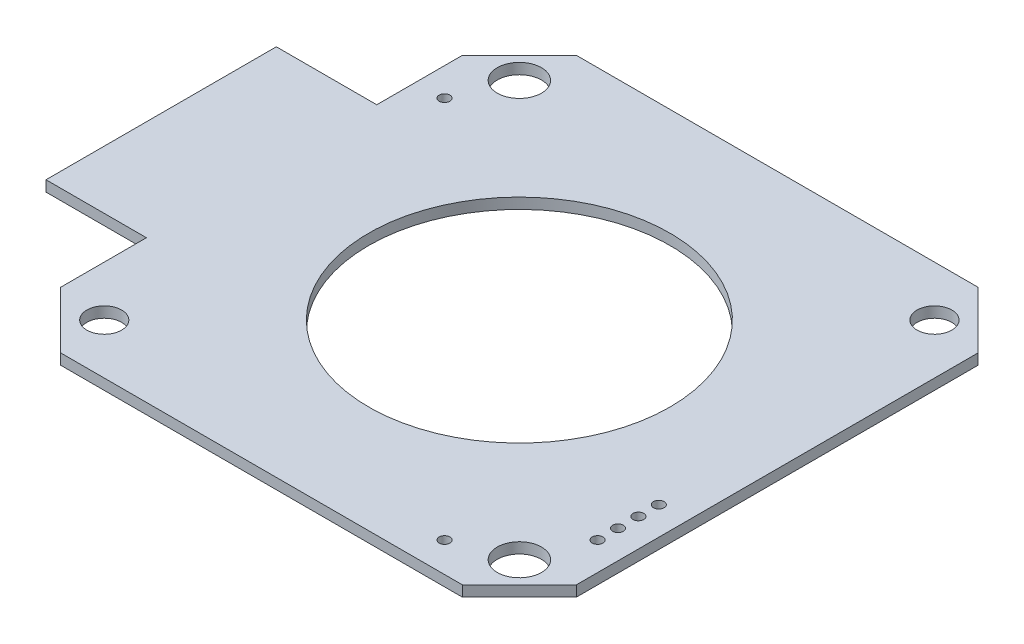
ISO-10303-21;
HEADER;
FILE_DESCRIPTION(('STEP AP214'),'2;1');
FILE_NAME('part.step','',(''),(''),'','','');
FILE_SCHEMA(('AUTOMOTIVE_DESIGN { 1 0 10303 214 1 1 1 1 }'));
ENDSEC;
DATA;
#1=APPLICATION_CONTEXT('core data for automotive mechanical design processes');
#2=APPLICATION_PROTOCOL_DEFINITION('international standard','automotive_design',2000,#1);
#3=PRODUCT_CONTEXT('',#1,'mechanical');
#4=PRODUCT('Part','Part','',(#3));
#5=PRODUCT_RELATED_PRODUCT_CATEGORY('part','',(#4));
#6=PRODUCT_DEFINITION_FORMATION('','',#4);
#7=PRODUCT_DEFINITION_CONTEXT('part definition',#1,'design');
#8=PRODUCT_DEFINITION('design','',#6,#7);
#9=PRODUCT_DEFINITION_SHAPE('','',#8);
#10=(LENGTH_UNIT() NAMED_UNIT(*) SI_UNIT(.MILLI.,.METRE.));
#11=(NAMED_UNIT(*) PLANE_ANGLE_UNIT() SI_UNIT($,.RADIAN.));
#12=(NAMED_UNIT(*) SI_UNIT($,.STERADIAN.) SOLID_ANGLE_UNIT());
#13=UNCERTAINTY_MEASURE_WITH_UNIT(LENGTH_MEASURE(1.E-05),#10,'distance_accuracy_value','');
#14=(GEOMETRIC_REPRESENTATION_CONTEXT(3) GLOBAL_UNCERTAINTY_ASSIGNED_CONTEXT((#13)) GLOBAL_UNIT_ASSIGNED_CONTEXT((#10,
#11,#12)) REPRESENTATION_CONTEXT('',''));
#15=CARTESIAN_POINT('',(0.,0.,0.));
#16=DIRECTION('',(0.,0.,1.));
#17=DIRECTION('',(1.,0.,0.));
#18=AXIS2_PLACEMENT_3D('',#15,#16,#17);
#19=CARTESIAN_POINT('',(0.,0.,0.));
#20=DIRECTION('',(0.,1.,0.));
#21=DIRECTION('',(1.,0.,0.));
#22=AXIS2_PLACEMENT_3D('',#19,#20,#21);
#23=PLANE('',#22);
#24=DIRECTION('',(-0.707106781186548,0.,0.707106781186548));
#25=VECTOR('',#24,1.);
#26=CARTESIAN_POINT('',(-15.,0.,-19.25));
#27=LINE('',#26,#25);
#28=CARTESIAN_POINT('',(-15.,0.,-19.25));
#29=VERTEX_POINT('',#28);
#30=CARTESIAN_POINT('',(-19.25,0.,-15.));
#31=VERTEX_POINT('',#30);
#32=EDGE_CURVE('E36',#29,#31,#27,.T.);
#33=ORIENTED_EDGE('',*,*,#32,.F.);
#34=DIRECTION('',(-1.,0.,0.));
#35=VECTOR('',#34,1.);
#36=CARTESIAN_POINT('',(15.,0.,-19.25));
#37=LINE('',#36,#35);
#38=CARTESIAN_POINT('',(15.,0.,-19.25));
#39=VERTEX_POINT('',#38);
#40=EDGE_CURVE('E166',#39,#29,#37,.T.);
#41=ORIENTED_EDGE('',*,*,#40,.F.);
#42=DIRECTION('',(-0.707106781186548,0.,-0.707106781186548));
#43=VECTOR('',#42,1.);
#44=CARTESIAN_POINT('',(19.25,0.,-15.));
#45=LINE('',#44,#43);
#46=CARTESIAN_POINT('',(19.25,0.,-15.));
#47=VERTEX_POINT('',#46);
#48=EDGE_CURVE('E163',#47,#39,#45,.T.);
#49=ORIENTED_EDGE('',*,*,#48,.F.);
#50=DIRECTION('',(0.,0.,-1.));
#51=VECTOR('',#50,1.);
#52=CARTESIAN_POINT('',(19.25,0.,15.));
#53=LINE('',#52,#51);
#54=CARTESIAN_POINT('',(19.25,0.,15.));
#55=VERTEX_POINT('',#54);
#56=EDGE_CURVE('E160',#55,#47,#53,.T.);
#57=ORIENTED_EDGE('',*,*,#56,.F.);
#58=DIRECTION('',(0.707106781186548,0.,-0.707106781186548));
#59=VECTOR('',#58,1.);
#60=CARTESIAN_POINT('',(15.,0.,19.25));
#61=LINE('',#60,#59);
#62=CARTESIAN_POINT('',(15.,0.,19.25));
#63=VERTEX_POINT('',#62);
#64=EDGE_CURVE('E156',#63,#55,#61,.T.);
#65=ORIENTED_EDGE('',*,*,#64,.F.);
#66=DIRECTION('',(1.,0.,0.));
#67=VECTOR('',#66,1.);
#68=CARTESIAN_POINT('',(-15.,0.,19.25));
#69=LINE('',#68,#67);
#70=CARTESIAN_POINT('',(-15.,0.,19.25));
#71=VERTEX_POINT('',#70);
#72=EDGE_CURVE('E152',#71,#63,#69,.T.);
#73=ORIENTED_EDGE('',*,*,#72,.F.);
#74=DIRECTION('',(0.707106781186548,0.,0.707106781186548));
#75=VECTOR('',#74,1.);
#76=CARTESIAN_POINT('',(-19.25,0.,15.));
#77=LINE('',#76,#75);
#78=CARTESIAN_POINT('',(-19.25,0.,15.));
#79=VERTEX_POINT('',#78);
#80=EDGE_CURVE('E151',#79,#71,#77,.T.);
#81=ORIENTED_EDGE('',*,*,#80,.F.);
#82=DIRECTION('',(0.,0.,1.));
#83=VECTOR('',#82,1.);
#84=CARTESIAN_POINT('',(-19.25,0.,8.6));
#85=LINE('',#84,#83);
#86=CARTESIAN_POINT('',(-19.25,0.,8.6));
#87=VERTEX_POINT('',#86);
#88=EDGE_CURVE('E127',#87,#79,#85,.T.);
#89=ORIENTED_EDGE('',*,*,#88,.F.);
#90=DIRECTION('',(-1.,0.,0.));
#91=VECTOR('',#90,1.);
#92=CARTESIAN_POINT('',(-19.25,0.,8.6));
#93=LINE('',#92,#91);
#94=CARTESIAN_POINT('',(-26.75,0.,8.6));
#95=VERTEX_POINT('',#94);
#96=EDGE_CURVE('E11',#87,#95,#93,.T.);
#97=ORIENTED_EDGE('',*,*,#96,.T.);
#98=DIRECTION('',(0.,0.,-1.));
#99=VECTOR('',#98,1.);
#100=CARTESIAN_POINT('',(-26.75,0.,8.6));
#101=LINE('',#100,#99);
#102=CARTESIAN_POINT('',(-26.75,0.,-8.6));
#103=VERTEX_POINT('',#102);
#104=EDGE_CURVE('E27',#95,#103,#101,.T.);
#105=ORIENTED_EDGE('',*,*,#104,.T.);
#106=DIRECTION('',(1.,0.,0.));
#107=VECTOR('',#106,1.);
#108=CARTESIAN_POINT('',(-26.75,0.,-8.6));
#109=LINE('',#108,#107);
#110=CARTESIAN_POINT('',(-19.25,0.,-8.6));
#111=VERTEX_POINT('',#110);
#112=EDGE_CURVE('E188',#103,#111,#109,.T.);
#113=ORIENTED_EDGE('',*,*,#112,.T.);
#114=DIRECTION('',(0.,0.,1.));
#115=VECTOR('',#114,1.);
#116=CARTESIAN_POINT('',(-19.25,0.,-15.));
#117=LINE('',#116,#115);
#118=EDGE_CURVE('E142',#31,#111,#117,.T.);
#119=ORIENTED_EDGE('',*,*,#118,.F.);
#120=EDGE_LOOP('',(#33,#41,#49,#57,#65,#73,#81,#89,#97,#105,#113,#119));
#121=FACE_BOUND('',#120,.T.);
#122=CARTESIAN_POINT('',(0.,0.,0.));
#123=DIRECTION('',(0.,1.,0.));
#124=DIRECTION('',(-1.,0.,0.));
#125=AXIS2_PLACEMENT_3D('',#122,#123,#124);
#126=CIRCLE('',#125,11.25);
#127=CARTESIAN_POINT('',(-11.25,0.,0.));
#128=VERTEX_POINT('',#127);
#129=EDGE_CURVE('E191',#128,#128,#126,.T.);
#130=ORIENTED_EDGE('',*,*,#129,.T.);
#131=EDGE_LOOP('',(#130));
#132=FACE_BOUND('',#131,.T.);
#133=CARTESIAN_POINT('',(15.5,0.,15.5));
#134=DIRECTION('',(0.,1.,0.));
#135=DIRECTION('',(1.,0.,0.));
#136=AXIS2_PLACEMENT_3D('',#133,#134,#135);
#137=CIRCLE('',#136,1.65);
#138=CARTESIAN_POINT('',(17.15,0.,15.5));
#139=VERTEX_POINT('',#138);
#140=EDGE_CURVE('E195',#139,#139,#137,.T.);
#141=ORIENTED_EDGE('',*,*,#140,.T.);
#142=EDGE_LOOP('',(#141));
#143=FACE_BOUND('',#142,.T.);
#144=CARTESIAN_POINT('',(-15.5,0.,-15.5));
#145=DIRECTION('',(0.,1.,0.));
#146=DIRECTION('',(1.,0.,0.));
#147=AXIS2_PLACEMENT_3D('',#144,#145,#146);
#148=CIRCLE('',#147,1.65);
#149=CARTESIAN_POINT('',(-13.85,0.,-15.5));
#150=VERTEX_POINT('',#149);
#151=EDGE_CURVE('E198',#150,#150,#148,.T.);
#152=ORIENTED_EDGE('',*,*,#151,.T.);
#153=EDGE_LOOP('',(#152));
#154=FACE_BOUND('',#153,.T.);
#155=CARTESIAN_POINT('',(15.5,0.,-15.5));
#156=DIRECTION('',(0.,1.,0.));
#157=DIRECTION('',(1.,0.,0.));
#158=AXIS2_PLACEMENT_3D('',#155,#156,#157);
#159=CIRCLE('',#158,1.3);
#160=CARTESIAN_POINT('',(16.8,0.,-15.5));
#161=VERTEX_POINT('',#160);
#162=EDGE_CURVE('E201',#161,#161,#159,.T.);
#163=ORIENTED_EDGE('',*,*,#162,.T.);
#164=EDGE_LOOP('',(#163));
#165=FACE_BOUND('',#164,.T.);
#166=CARTESIAN_POINT('',(-15.5,0.,15.5));
#167=DIRECTION('',(0.,1.,0.));
#168=DIRECTION('',(1.,0.,0.));
#169=AXIS2_PLACEMENT_3D('',#166,#167,#168);
#170=CIRCLE('',#169,1.3);
#171=CARTESIAN_POINT('',(-14.2,0.,15.5));
#172=VERTEX_POINT('',#171);
#173=EDGE_CURVE('E204',#172,#172,#170,.T.);
#174=ORIENTED_EDGE('',*,*,#173,.T.);
#175=EDGE_LOOP('',(#174));
#176=FACE_BOUND('',#175,.T.);
#177=CARTESIAN_POINT('',(-17.14503,0.,-11.556898));
#178=DIRECTION('',(0.,1.,0.));
#179=DIRECTION('',(0.,0.,-1.));
#180=AXIS2_PLACEMENT_3D('',#177,#178,#179);
#181=CIRCLE('',#180,0.4);
#182=CARTESIAN_POINT('',(-17.14503,0.,-11.956898));
#183=VERTEX_POINT('',#182);
#184=EDGE_CURVE('E207',#183,#183,#181,.T.);
#185=ORIENTED_EDGE('',*,*,#184,.T.);
#186=EDGE_LOOP('',(#185));
#187=FACE_BOUND('',#186,.T.);
#188=CARTESIAN_POINT('',(11.42997,0.,17.018102));
#189=DIRECTION('',(0.,1.,0.));
#190=DIRECTION('',(0.,0.,-1.));
#191=AXIS2_PLACEMENT_3D('',#188,#189,#190);
#192=CIRCLE('',#191,0.4);
#193=CARTESIAN_POINT('',(11.42997,0.,16.618102));
#194=VERTEX_POINT('',#193);
#195=EDGE_CURVE('E210',#194,#194,#192,.T.);
#196=ORIENTED_EDGE('',*,*,#195,.T.);
#197=EDGE_LOOP('',(#196));
#198=FACE_BOUND('',#197,.T.);
#199=CARTESIAN_POINT('',(17.14497,0.,6.731102));
#200=DIRECTION('',(0.,1.,0.));
#201=DIRECTION('',(0.,0.,-1.));
#202=AXIS2_PLACEMENT_3D('',#199,#200,#201);
#203=CIRCLE('',#202,0.4);
#204=CARTESIAN_POINT('',(17.14497,0.,6.331102));
#205=VERTEX_POINT('',#204);
#206=EDGE_CURVE('E213',#205,#205,#203,.T.);
#207=ORIENTED_EDGE('',*,*,#206,.T.);
#208=EDGE_LOOP('',(#207));
#209=FACE_BOUND('',#208,.T.);
#210=CARTESIAN_POINT('',(17.14497,0.,8.255102));
#211=DIRECTION('',(0.,1.,0.));
#212=DIRECTION('',(0.,0.,-1.));
#213=AXIS2_PLACEMENT_3D('',#210,#211,#212);
#214=CIRCLE('',#213,0.4);
#215=CARTESIAN_POINT('',(17.14497,0.,7.855102));
#216=VERTEX_POINT('',#215);
#217=EDGE_CURVE('E216',#216,#216,#214,.T.);
#218=ORIENTED_EDGE('',*,*,#217,.T.);
#219=EDGE_LOOP('',(#218));
#220=FACE_BOUND('',#219,.T.);
#221=CARTESIAN_POINT('',(17.14497,0.,9.779102));
#222=DIRECTION('',(0.,1.,0.));
#223=DIRECTION('',(0.,0.,-1.));
#224=AXIS2_PLACEMENT_3D('',#221,#222,#223);
#225=CIRCLE('',#224,0.4);
#226=CARTESIAN_POINT('',(17.14497,0.,9.379102));
#227=VERTEX_POINT('',#226);
#228=EDGE_CURVE('E219',#227,#227,#225,.T.);
#229=ORIENTED_EDGE('',*,*,#228,.T.);
#230=EDGE_LOOP('',(#229));
#231=FACE_BOUND('',#230,.T.);
#232=CARTESIAN_POINT('',(17.14497,0.,11.303102));
#233=DIRECTION('',(0.,1.,0.));
#234=DIRECTION('',(0.,0.,-1.));
#235=AXIS2_PLACEMENT_3D('',#232,#233,#234);
#236=CIRCLE('',#235,0.4);
#237=CARTESIAN_POINT('',(17.14497,0.,10.903102));
#238=VERTEX_POINT('',#237);
#239=EDGE_CURVE('E222',#238,#238,#236,.T.);
#240=ORIENTED_EDGE('',*,*,#239,.T.);
#241=EDGE_LOOP('',(#240));
#242=FACE_BOUND('',#241,.T.);
#243=ADVANCED_FACE('F17',(#121,#132,#143,#154,#165,#176,#187,#198,#209,#220,#231,#242),#23,.F.);
#244=CARTESIAN_POINT('',(0.,0.8,0.));
#245=DIRECTION('',(0.,1.,0.));
#246=DIRECTION('',(1.,0.,0.));
#247=AXIS2_PLACEMENT_3D('',#244,#245,#246);
#248=CYLINDRICAL_SURFACE('',#247,11.25);
#249=ORIENTED_EDGE('',*,*,#129,.F.);
#250=EDGE_LOOP('',(#249));
#251=FACE_BOUND('',#250,.T.);
#252=CARTESIAN_POINT('',(0.,0.8,0.));
#253=DIRECTION('',(0.,1.,0.));
#254=DIRECTION('',(1.,0.,0.));
#255=AXIS2_PLACEMENT_3D('',#252,#253,#254);
#256=CIRCLE('',#255,11.25);
#257=CARTESIAN_POINT('',(11.25,0.8,0.));
#258=VERTEX_POINT('',#257);
#259=EDGE_CURVE('E225',#258,#258,#256,.T.);
#260=ORIENTED_EDGE('',*,*,#259,.T.);
#261=EDGE_LOOP('',(#260));
#262=FACE_BOUND('',#261,.T.);
#263=ADVANCED_FACE('F283',(#251,#262),#248,.F.);
#264=CARTESIAN_POINT('',(0.,0.8,0.));
#265=DIRECTION('',(0.,1.,0.));
#266=DIRECTION('',(1.,0.,0.));
#267=AXIS2_PLACEMENT_3D('',#264,#265,#266);
#268=PLANE('',#267);
#269=DIRECTION('',(0.707106781186548,0.,0.707106781186548));
#270=VECTOR('',#269,1.);
#271=CARTESIAN_POINT('',(-19.25,0.8,15.));
#272=LINE('',#271,#270);
#273=CARTESIAN_POINT('',(-19.25,0.8,15.));
#274=VERTEX_POINT('',#273);
#275=CARTESIAN_POINT('',(-15.,0.8,19.25));
#276=VERTEX_POINT('',#275);
#277=EDGE_CURVE('E228',#274,#276,#272,.T.);
#278=ORIENTED_EDGE('',*,*,#277,.T.);
#279=DIRECTION('',(1.,0.,0.));
#280=VECTOR('',#279,1.);
#281=CARTESIAN_POINT('',(-15.,0.8,19.25));
#282=LINE('',#281,#280);
#283=CARTESIAN_POINT('',(15.,0.8,19.25));
#284=VERTEX_POINT('',#283);
#285=EDGE_CURVE('E230',#276,#284,#282,.T.);
#286=ORIENTED_EDGE('',*,*,#285,.T.);
#287=DIRECTION('',(0.707106781186548,0.,-0.707106781186548));
#288=VECTOR('',#287,1.);
#289=CARTESIAN_POINT('',(15.,0.8,19.25));
#290=LINE('',#289,#288);
#291=CARTESIAN_POINT('',(19.25,0.8,15.));
#292=VERTEX_POINT('',#291);
#293=EDGE_CURVE('E233',#284,#292,#290,.T.);
#294=ORIENTED_EDGE('',*,*,#293,.T.);
#295=DIRECTION('',(0.,0.,-1.));
#296=VECTOR('',#295,1.);
#297=CARTESIAN_POINT('',(19.25,0.8,15.));
#298=LINE('',#297,#296);
#299=CARTESIAN_POINT('',(19.25,0.8,-15.));
#300=VERTEX_POINT('',#299);
#301=EDGE_CURVE('E236',#292,#300,#298,.T.);
#302=ORIENTED_EDGE('',*,*,#301,.T.);
#303=DIRECTION('',(-0.707106781186548,0.,-0.707106781186548));
#304=VECTOR('',#303,1.);
#305=CARTESIAN_POINT('',(19.25,0.8,-15.));
#306=LINE('',#305,#304);
#307=CARTESIAN_POINT('',(15.,0.8,-19.25));
#308=VERTEX_POINT('',#307);
#309=EDGE_CURVE('E239',#300,#308,#306,.T.);
#310=ORIENTED_EDGE('',*,*,#309,.T.);
#311=DIRECTION('',(-1.,0.,0.));
#312=VECTOR('',#311,1.);
#313=CARTESIAN_POINT('',(15.,0.8,-19.25));
#314=LINE('',#313,#312);
#315=CARTESIAN_POINT('',(-15.,0.8,-19.25));
#316=VERTEX_POINT('',#315);
#317=EDGE_CURVE('E242',#308,#316,#314,.T.);
#318=ORIENTED_EDGE('',*,*,#317,.T.);
#319=DIRECTION('',(-0.707106781186548,0.,0.707106781186548));
#320=VECTOR('',#319,1.);
#321=CARTESIAN_POINT('',(-15.,0.8,-19.25));
#322=LINE('',#321,#320);
#323=CARTESIAN_POINT('',(-19.25,0.8,-15.));
#324=VERTEX_POINT('',#323);
#325=EDGE_CURVE('E245',#316,#324,#322,.T.);
#326=ORIENTED_EDGE('',*,*,#325,.T.);
#327=DIRECTION('',(0.,0.,1.));
#328=VECTOR('',#327,1.);
#329=CARTESIAN_POINT('',(-19.25,0.8,-15.));
#330=LINE('',#329,#328);
#331=CARTESIAN_POINT('',(-19.25,0.8,-8.6));
#332=VERTEX_POINT('',#331);
#333=EDGE_CURVE('E126',#324,#332,#330,.T.);
#334=ORIENTED_EDGE('',*,*,#333,.T.);
#335=DIRECTION('',(1.,0.,0.));
#336=VECTOR('',#335,1.);
#337=CARTESIAN_POINT('',(-26.75,0.8,-8.6));
#338=LINE('',#337,#336);
#339=CARTESIAN_POINT('',(-26.75,0.8,-8.6));
#340=VERTEX_POINT('',#339);
#341=EDGE_CURVE('E147',#340,#332,#338,.T.);
#342=ORIENTED_EDGE('',*,*,#341,.F.);
#343=DIRECTION('',(0.,0.,-1.));
#344=VECTOR('',#343,1.);
#345=CARTESIAN_POINT('',(-26.75,0.8,8.6));
#346=LINE('',#345,#344);
#347=CARTESIAN_POINT('',(-26.75,0.8,8.6));
#348=VERTEX_POINT('',#347);
#349=EDGE_CURVE('E103',#348,#340,#346,.T.);
#350=ORIENTED_EDGE('',*,*,#349,.F.);
#351=DIRECTION('',(-1.,0.,0.));
#352=VECTOR('',#351,1.);
#353=CARTESIAN_POINT('',(-19.25,0.8,8.6));
#354=LINE('',#353,#352);
#355=CARTESIAN_POINT('',(-19.25,0.8,8.6));
#356=VERTEX_POINT('',#355);
#357=EDGE_CURVE('E105',#356,#348,#354,.T.);
#358=ORIENTED_EDGE('',*,*,#357,.F.);
#359=DIRECTION('',(0.,0.,1.));
#360=VECTOR('',#359,1.);
#361=CARTESIAN_POINT('',(-19.25,0.8,8.6));
#362=LINE('',#361,#360);
#363=EDGE_CURVE('E110',#356,#274,#362,.T.);
#364=ORIENTED_EDGE('',*,*,#363,.T.);
#365=EDGE_LOOP('',(#278,#286,#294,#302,#310,#318,#326,#334,#342,#350,#358,#364));
#366=FACE_BOUND('',#365,.T.);
#367=ORIENTED_EDGE('',*,*,#259,.F.);
#368=EDGE_LOOP('',(#367));
#369=FACE_BOUND('',#368,.T.);
#370=CARTESIAN_POINT('',(15.5,0.8,15.5));
#371=DIRECTION('',(0.,1.,0.));
#372=DIRECTION('',(1.,0.,0.));
#373=AXIS2_PLACEMENT_3D('',#370,#371,#372);
#374=CIRCLE('',#373,1.65);
#375=CARTESIAN_POINT('',(17.15,0.8,15.5));
#376=VERTEX_POINT('',#375);
#377=EDGE_CURVE('E140',#376,#376,#374,.T.);
#378=ORIENTED_EDGE('',*,*,#377,.F.);
#379=EDGE_LOOP('',(#378));
#380=FACE_BOUND('',#379,.T.);
#381=CARTESIAN_POINT('',(-15.5,0.8,-15.5));
#382=DIRECTION('',(0.,1.,0.));
#383=DIRECTION('',(1.,0.,0.));
#384=AXIS2_PLACEMENT_3D('',#381,#382,#383);
#385=CIRCLE('',#384,1.65);
#386=CARTESIAN_POINT('',(-13.85,0.8,-15.5));
#387=VERTEX_POINT('',#386);
#388=EDGE_CURVE('E254',#387,#387,#385,.T.);
#389=ORIENTED_EDGE('',*,*,#388,.F.);
#390=EDGE_LOOP('',(#389));
#391=FACE_BOUND('',#390,.T.);
#392=CARTESIAN_POINT('',(15.5,0.8,-15.5));
#393=DIRECTION('',(0.,1.,0.));
#394=DIRECTION('',(1.,0.,0.));
#395=AXIS2_PLACEMENT_3D('',#392,#393,#394);
#396=CIRCLE('',#395,1.3);
#397=CARTESIAN_POINT('',(16.8,0.8,-15.5));
#398=VERTEX_POINT('',#397);
#399=EDGE_CURVE('E257',#398,#398,#396,.T.);
#400=ORIENTED_EDGE('',*,*,#399,.F.);
#401=EDGE_LOOP('',(#400));
#402=FACE_BOUND('',#401,.T.);
#403=CARTESIAN_POINT('',(-15.5,0.8,15.5));
#404=DIRECTION('',(0.,1.,0.));
#405=DIRECTION('',(1.,0.,0.));
#406=AXIS2_PLACEMENT_3D('',#403,#404,#405);
#407=CIRCLE('',#406,1.3);
#408=CARTESIAN_POINT('',(-14.2,0.8,15.5));
#409=VERTEX_POINT('',#408);
#410=EDGE_CURVE('E260',#409,#409,#407,.T.);
#411=ORIENTED_EDGE('',*,*,#410,.F.);
#412=EDGE_LOOP('',(#411));
#413=FACE_BOUND('',#412,.T.);
#414=CARTESIAN_POINT('',(-17.14503,0.8,-11.556898));
#415=DIRECTION('',(0.,1.,0.));
#416=DIRECTION('',(0.,0.,-1.));
#417=AXIS2_PLACEMENT_3D('',#414,#415,#416);
#418=CIRCLE('',#417,0.4);
#419=CARTESIAN_POINT('',(-17.14503,0.8,-11.956898));
#420=VERTEX_POINT('',#419);
#421=EDGE_CURVE('E263',#420,#420,#418,.T.);
#422=ORIENTED_EDGE('',*,*,#421,.F.);
#423=EDGE_LOOP('',(#422));
#424=FACE_BOUND('',#423,.T.);
#425=CARTESIAN_POINT('',(11.42997,0.8,17.018102));
#426=DIRECTION('',(0.,1.,0.));
#427=DIRECTION('',(0.,0.,-1.));
#428=AXIS2_PLACEMENT_3D('',#425,#426,#427);
#429=CIRCLE('',#428,0.4);
#430=CARTESIAN_POINT('',(11.42997,0.8,16.618102));
#431=VERTEX_POINT('',#430);
#432=EDGE_CURVE('E266',#431,#431,#429,.T.);
#433=ORIENTED_EDGE('',*,*,#432,.F.);
#434=EDGE_LOOP('',(#433));
#435=FACE_BOUND('',#434,.T.);
#436=CARTESIAN_POINT('',(17.14497,0.8,6.731102));
#437=DIRECTION('',(0.,1.,0.));
#438=DIRECTION('',(0.,0.,-1.));
#439=AXIS2_PLACEMENT_3D('',#436,#437,#438);
#440=CIRCLE('',#439,0.4);
#441=CARTESIAN_POINT('',(17.14497,0.8,6.331102));
#442=VERTEX_POINT('',#441);
#443=EDGE_CURVE('E269',#442,#442,#440,.T.);
#444=ORIENTED_EDGE('',*,*,#443,.F.);
#445=EDGE_LOOP('',(#444));
#446=FACE_BOUND('',#445,.T.);
#447=CARTESIAN_POINT('',(17.14497,0.8,8.255102));
#448=DIRECTION('',(0.,1.,0.));
#449=DIRECTION('',(0.,0.,-1.));
#450=AXIS2_PLACEMENT_3D('',#447,#448,#449);
#451=CIRCLE('',#450,0.4);
#452=CARTESIAN_POINT('',(17.14497,0.8,7.855102));
#453=VERTEX_POINT('',#452);
#454=EDGE_CURVE('E272',#453,#453,#451,.T.);
#455=ORIENTED_EDGE('',*,*,#454,.F.);
#456=EDGE_LOOP('',(#455));
#457=FACE_BOUND('',#456,.T.);
#458=CARTESIAN_POINT('',(17.14497,0.8,9.779102));
#459=DIRECTION('',(0.,1.,0.));
#460=DIRECTION('',(0.,0.,-1.));
#461=AXIS2_PLACEMENT_3D('',#458,#459,#460);
#462=CIRCLE('',#461,0.4);
#463=CARTESIAN_POINT('',(17.14497,0.8,9.379102));
#464=VERTEX_POINT('',#463);
#465=EDGE_CURVE('E275',#464,#464,#462,.T.);
#466=ORIENTED_EDGE('',*,*,#465,.F.);
#467=EDGE_LOOP('',(#466));
#468=FACE_BOUND('',#467,.T.);
#469=CARTESIAN_POINT('',(17.14497,0.8,11.303102));
#470=DIRECTION('',(0.,1.,0.));
#471=DIRECTION('',(0.,0.,-1.));
#472=AXIS2_PLACEMENT_3D('',#469,#470,#471);
#473=CIRCLE('',#472,0.4);
#474=CARTESIAN_POINT('',(17.14497,0.8,10.903102));
#475=VERTEX_POINT('',#474);
#476=EDGE_CURVE('E277',#475,#475,#473,.T.);
#477=ORIENTED_EDGE('',*,*,#476,.F.);
#478=EDGE_LOOP('',(#477));
#479=FACE_BOUND('',#478,.T.);
#480=ADVANCED_FACE('F108',(#366,#369,#380,#391,#402,#413,#424,#435,#446,#457,#468,#479),#268,.T.);
#481=CARTESIAN_POINT('',(-19.25,0.,-19.25));
#482=DIRECTION('',(-1.,0.,0.));
#483=DIRECTION('',(0.,0.,1.));
#484=AXIS2_PLACEMENT_3D('',#481,#482,#483);
#485=PLANE('',#484);
#486=ORIENTED_EDGE('',*,*,#88,.T.);
#487=DIRECTION('',(0.,1.,0.));
#488=VECTOR('',#487,1.);
#489=CARTESIAN_POINT('',(-19.25,0.,15.));
#490=LINE('',#489,#488);
#491=EDGE_CURVE('E125',#79,#274,#490,.T.);
#492=ORIENTED_EDGE('',*,*,#491,.T.);
#493=ORIENTED_EDGE('',*,*,#363,.F.);
#494=DIRECTION('',(0.,1.,0.));
#495=VECTOR('',#494,1.);
#496=CARTESIAN_POINT('',(-19.25,0.,8.6));
#497=LINE('',#496,#495);
#498=EDGE_CURVE('E117',#87,#356,#497,.T.);
#499=ORIENTED_EDGE('',*,*,#498,.F.);
#500=EDGE_LOOP('',(#486,#492,#493,#499));
#501=FACE_BOUND('',#500,.T.);
#502=ADVANCED_FACE('F123',(#501),#485,.T.);
#503=CARTESIAN_POINT('',(-19.25,0.,-19.25));
#504=DIRECTION('',(-1.,0.,0.));
#505=DIRECTION('',(0.,0.,1.));
#506=AXIS2_PLACEMENT_3D('',#503,#504,#505);
#507=PLANE('',#506);
#508=ORIENTED_EDGE('',*,*,#333,.F.);
#509=DIRECTION('',(0.,1.,0.));
#510=VECTOR('',#509,1.);
#511=CARTESIAN_POINT('',(-19.25,0.,-15.));
#512=LINE('',#511,#510);
#513=EDGE_CURVE('E137',#31,#324,#512,.T.);
#514=ORIENTED_EDGE('',*,*,#513,.F.);
#515=ORIENTED_EDGE('',*,*,#118,.T.);
#516=DIRECTION('',(0.,1.,0.));
#517=VECTOR('',#516,1.);
#518=CARTESIAN_POINT('',(-19.25,0.,-8.6));
#519=LINE('',#518,#517);
#520=EDGE_CURVE('E116',#111,#332,#519,.T.);
#521=ORIENTED_EDGE('',*,*,#520,.T.);
#522=EDGE_LOOP('',(#508,#514,#515,#521));
#523=FACE_BOUND('',#522,.T.);
#524=ADVANCED_FACE('F291',(#523),#507,.T.);
#525=CARTESIAN_POINT('',(-19.25,0.,8.6));
#526=DIRECTION('',(0.,0.,1.));
#527=DIRECTION('',(-1.,0.,0.));
#528=AXIS2_PLACEMENT_3D('',#525,#526,#527);
#529=PLANE('',#528);
#530=ORIENTED_EDGE('',*,*,#357,.T.);
#531=DIRECTION('',(0.,1.,0.));
#532=VECTOR('',#531,1.);
#533=CARTESIAN_POINT('',(-26.75,0.,8.6));
#534=LINE('',#533,#532);
#535=EDGE_CURVE('E131',#95,#348,#534,.T.);
#536=ORIENTED_EDGE('',*,*,#535,.F.);
#537=ORIENTED_EDGE('',*,*,#96,.F.);
#538=ORIENTED_EDGE('',*,*,#498,.T.);
#539=EDGE_LOOP('',(#530,#536,#537,#538));
#540=FACE_BOUND('',#539,.T.);
#541=ADVANCED_FACE('F130',(#540),#529,.T.);
#542=CARTESIAN_POINT('',(-26.75,0.,8.6));
#543=DIRECTION('',(-1.,0.,0.));
#544=DIRECTION('',(0.,0.,-1.));
#545=AXIS2_PLACEMENT_3D('',#542,#543,#544);
#546=PLANE('',#545);
#547=ORIENTED_EDGE('',*,*,#535,.T.);
#548=ORIENTED_EDGE('',*,*,#349,.T.);
#549=DIRECTION('',(0.,1.,0.));
#550=VECTOR('',#549,1.);
#551=CARTESIAN_POINT('',(-26.75,0.,-8.6));
#552=LINE('',#551,#550);
#553=EDGE_CURVE('E144',#103,#340,#552,.T.);
#554=ORIENTED_EDGE('',*,*,#553,.F.);
#555=ORIENTED_EDGE('',*,*,#104,.F.);
#556=EDGE_LOOP('',(#547,#548,#554,#555));
#557=FACE_BOUND('',#556,.T.);
#558=ADVANCED_FACE('F396',(#557),#546,.T.);
#559=CARTESIAN_POINT('',(-26.75,0.,-8.6));
#560=DIRECTION('',(0.,0.,-1.));
#561=DIRECTION('',(1.,0.,0.));
#562=AXIS2_PLACEMENT_3D('',#559,#560,#561);
#563=PLANE('',#562);
#564=ORIENTED_EDGE('',*,*,#112,.F.);
#565=ORIENTED_EDGE('',*,*,#553,.T.);
#566=ORIENTED_EDGE('',*,*,#341,.T.);
#567=ORIENTED_EDGE('',*,*,#520,.F.);
#568=EDGE_LOOP('',(#564,#565,#566,#567));
#569=FACE_BOUND('',#568,.T.);
#570=ADVANCED_FACE('F392',(#569),#563,.T.);
#571=CARTESIAN_POINT('',(-19.25,0.,15.));
#572=DIRECTION('',(0.707106781186548,0.,-0.707106781186548));
#573=DIRECTION('',(0.707106781186548,0.,0.707106781186548));
#574=AXIS2_PLACEMENT_3D('',#571,#572,#573);
#575=PLANE('',#574);
#576=ORIENTED_EDGE('',*,*,#491,.F.);
#577=ORIENTED_EDGE('',*,*,#80,.T.);
#578=DIRECTION('',(0.,1.,0.));
#579=VECTOR('',#578,1.);
#580=CARTESIAN_POINT('',(-15.,0.,19.25));
#581=LINE('',#580,#579);
#582=EDGE_CURVE('E148',#71,#276,#581,.T.);
#583=ORIENTED_EDGE('',*,*,#582,.T.);
#584=ORIENTED_EDGE('',*,*,#277,.F.);
#585=EDGE_LOOP('',(#576,#577,#583,#584));
#586=FACE_BOUND('',#585,.T.);
#587=ADVANCED_FACE('F388',(#586),#575,.F.);
#588=CARTESIAN_POINT('',(-19.25,0.,19.25));
#589=DIRECTION('',(0.,0.,1.));
#590=DIRECTION('',(1.,0.,0.));
#591=AXIS2_PLACEMENT_3D('',#588,#589,#590);
#592=PLANE('',#591);
#593=ORIENTED_EDGE('',*,*,#285,.F.);
#594=ORIENTED_EDGE('',*,*,#582,.F.);
#595=ORIENTED_EDGE('',*,*,#72,.T.);
#596=DIRECTION('',(0.,1.,0.));
#597=VECTOR('',#596,1.);
#598=CARTESIAN_POINT('',(15.,0.,19.25));
#599=LINE('',#598,#597);
#600=EDGE_CURVE('E153',#63,#284,#599,.T.);
#601=ORIENTED_EDGE('',*,*,#600,.T.);
#602=EDGE_LOOP('',(#593,#594,#595,#601));
#603=FACE_BOUND('',#602,.T.);
#604=ADVANCED_FACE('F384',(#603),#592,.T.);
#605=CARTESIAN_POINT('',(15.,0.,19.25));
#606=DIRECTION('',(-0.707106781186548,0.,-0.707106781186548));
#607=DIRECTION('',(0.707106781186548,0.,-0.707106781186548));
#608=AXIS2_PLACEMENT_3D('',#605,#606,#607);
#609=PLANE('',#608);
#610=ORIENTED_EDGE('',*,*,#600,.F.);
#611=ORIENTED_EDGE('',*,*,#64,.T.);
#612=DIRECTION('',(0.,1.,0.));
#613=VECTOR('',#612,1.);
#614=CARTESIAN_POINT('',(19.25,0.,15.));
#615=LINE('',#614,#613);
#616=EDGE_CURVE('E157',#55,#292,#615,.T.);
#617=ORIENTED_EDGE('',*,*,#616,.T.);
#618=ORIENTED_EDGE('',*,*,#293,.F.);
#619=EDGE_LOOP('',(#610,#611,#617,#618));
#620=FACE_BOUND('',#619,.T.);
#621=ADVANCED_FACE('F380',(#620),#609,.F.);
#622=CARTESIAN_POINT('',(19.25,0.,19.25));
#623=DIRECTION('',(1.,0.,0.));
#624=DIRECTION('',(0.,0.,-1.));
#625=AXIS2_PLACEMENT_3D('',#622,#623,#624);
#626=PLANE('',#625);
#627=ORIENTED_EDGE('',*,*,#301,.F.);
#628=ORIENTED_EDGE('',*,*,#616,.F.);
#629=ORIENTED_EDGE('',*,*,#56,.T.);
#630=DIRECTION('',(0.,1.,0.));
#631=VECTOR('',#630,1.);
#632=CARTESIAN_POINT('',(19.25,0.,-15.));
#633=LINE('',#632,#631);
#634=EDGE_CURVE('E161',#47,#300,#633,.T.);
#635=ORIENTED_EDGE('',*,*,#634,.T.);
#636=EDGE_LOOP('',(#627,#628,#629,#635));
#637=FACE_BOUND('',#636,.T.);
#638=ADVANCED_FACE('F377',(#637),#626,.T.);
#639=CARTESIAN_POINT('',(19.25,0.,-15.));
#640=DIRECTION('',(-0.707106781186548,0.,0.707106781186548));
#641=DIRECTION('',(-0.707106781186548,0.,-0.707106781186548));
#642=AXIS2_PLACEMENT_3D('',#639,#640,#641);
#643=PLANE('',#642);
#644=ORIENTED_EDGE('',*,*,#634,.F.);
#645=ORIENTED_EDGE('',*,*,#48,.T.);
#646=DIRECTION('',(0.,1.,0.));
#647=VECTOR('',#646,1.);
#648=CARTESIAN_POINT('',(15.,0.,-19.25));
#649=LINE('',#648,#647);
#650=EDGE_CURVE('E164',#39,#308,#649,.T.);
#651=ORIENTED_EDGE('',*,*,#650,.T.);
#652=ORIENTED_EDGE('',*,*,#309,.F.);
#653=EDGE_LOOP('',(#644,#645,#651,#652));
#654=FACE_BOUND('',#653,.T.);
#655=ADVANCED_FACE('F374',(#654),#643,.F.);
#656=CARTESIAN_POINT('',(19.25,0.,-19.25));
#657=DIRECTION('',(0.,0.,-1.));
#658=DIRECTION('',(-1.,0.,0.));
#659=AXIS2_PLACEMENT_3D('',#656,#657,#658);
#660=PLANE('',#659);
#661=ORIENTED_EDGE('',*,*,#40,.T.);
#662=DIRECTION('',(0.,1.,0.));
#663=VECTOR('',#662,1.);
#664=CARTESIAN_POINT('',(-15.,0.,-19.25));
#665=LINE('',#664,#663);
#666=EDGE_CURVE('E21',#29,#316,#665,.T.);
#667=ORIENTED_EDGE('',*,*,#666,.T.);
#668=ORIENTED_EDGE('',*,*,#317,.F.);
#669=ORIENTED_EDGE('',*,*,#650,.F.);
#670=EDGE_LOOP('',(#661,#667,#668,#669));
#671=FACE_BOUND('',#670,.T.);
#672=ADVANCED_FACE('F370',(#671),#660,.T.);
#673=CARTESIAN_POINT('',(-15.,0.,-19.25));
#674=DIRECTION('',(0.707106781186548,0.,0.707106781186548));
#675=DIRECTION('',(-0.707106781186548,0.,0.707106781186548));
#676=AXIS2_PLACEMENT_3D('',#673,#674,#675);
#677=PLANE('',#676);
#678=ORIENTED_EDGE('',*,*,#666,.F.);
#679=ORIENTED_EDGE('',*,*,#32,.T.);
#680=ORIENTED_EDGE('',*,*,#513,.T.);
#681=ORIENTED_EDGE('',*,*,#325,.F.);
#682=EDGE_LOOP('',(#678,#679,#680,#681));
#683=FACE_BOUND('',#682,.T.);
#684=ADVANCED_FACE('F366',(#683),#677,.F.);
#685=CARTESIAN_POINT('',(15.5,0.8,15.5));
#686=DIRECTION('',(0.,1.,0.));
#687=DIRECTION('',(-1.,0.,0.));
#688=AXIS2_PLACEMENT_3D('',#685,#686,#687);
#689=CYLINDRICAL_SURFACE('',#688,1.65);
#690=ORIENTED_EDGE('',*,*,#140,.F.);
#691=EDGE_LOOP('',(#690));
#692=FACE_BOUND('',#691,.T.);
#693=ORIENTED_EDGE('',*,*,#377,.T.);
#694=EDGE_LOOP('',(#693));
#695=FACE_BOUND('',#694,.T.);
#696=ADVANCED_FACE('F362',(#692,#695),#689,.F.);
#697=CARTESIAN_POINT('',(-15.5,0.8,-15.5));
#698=DIRECTION('',(0.,1.,0.));
#699=DIRECTION('',(-1.,0.,0.));
#700=AXIS2_PLACEMENT_3D('',#697,#698,#699);
#701=CYLINDRICAL_SURFACE('',#700,1.65);
#702=ORIENTED_EDGE('',*,*,#151,.F.);
#703=EDGE_LOOP('',(#702));
#704=FACE_BOUND('',#703,.T.);
#705=ORIENTED_EDGE('',*,*,#388,.T.);
#706=EDGE_LOOP('',(#705));
#707=FACE_BOUND('',#706,.T.);
#708=ADVANCED_FACE('F358',(#704,#707),#701,.F.);
#709=CARTESIAN_POINT('',(15.5,0.8,-15.5));
#710=DIRECTION('',(0.,1.,0.));
#711=DIRECTION('',(-1.,0.,0.));
#712=AXIS2_PLACEMENT_3D('',#709,#710,#711);
#713=CYLINDRICAL_SURFACE('',#712,1.3);
#714=ORIENTED_EDGE('',*,*,#162,.F.);
#715=EDGE_LOOP('',(#714));
#716=FACE_BOUND('',#715,.T.);
#717=ORIENTED_EDGE('',*,*,#399,.T.);
#718=EDGE_LOOP('',(#717));
#719=FACE_BOUND('',#718,.T.);
#720=ADVANCED_FACE('F354',(#716,#719),#713,.F.);
#721=CARTESIAN_POINT('',(-15.5,0.8,15.5));
#722=DIRECTION('',(0.,1.,0.));
#723=DIRECTION('',(-1.,0.,0.));
#724=AXIS2_PLACEMENT_3D('',#721,#722,#723);
#725=CYLINDRICAL_SURFACE('',#724,1.3);
#726=ORIENTED_EDGE('',*,*,#173,.F.);
#727=EDGE_LOOP('',(#726));
#728=FACE_BOUND('',#727,.T.);
#729=ORIENTED_EDGE('',*,*,#410,.T.);
#730=EDGE_LOOP('',(#729));
#731=FACE_BOUND('',#730,.T.);
#732=ADVANCED_FACE('F350',(#728,#731),#725,.F.);
#733=CARTESIAN_POINT('',(-17.14503,0.8,-11.556898));
#734=DIRECTION('',(0.,1.,0.));
#735=DIRECTION('',(0.,0.,1.));
#736=AXIS2_PLACEMENT_3D('',#733,#734,#735);
#737=CYLINDRICAL_SURFACE('',#736,0.4);
#738=ORIENTED_EDGE('',*,*,#184,.F.);
#739=EDGE_LOOP('',(#738));
#740=FACE_BOUND('',#739,.T.);
#741=ORIENTED_EDGE('',*,*,#421,.T.);
#742=EDGE_LOOP('',(#741));
#743=FACE_BOUND('',#742,.T.);
#744=ADVANCED_FACE('F346',(#740,#743),#737,.F.);
#745=CARTESIAN_POINT('',(11.42997,0.8,17.018102));
#746=DIRECTION('',(0.,1.,0.));
#747=DIRECTION('',(0.,0.,1.));
#748=AXIS2_PLACEMENT_3D('',#745,#746,#747);
#749=CYLINDRICAL_SURFACE('',#748,0.4);
#750=ORIENTED_EDGE('',*,*,#195,.F.);
#751=EDGE_LOOP('',(#750));
#752=FACE_BOUND('',#751,.T.);
#753=ORIENTED_EDGE('',*,*,#432,.T.);
#754=EDGE_LOOP('',(#753));
#755=FACE_BOUND('',#754,.T.);
#756=ADVANCED_FACE('F342',(#752,#755),#749,.F.);
#757=CARTESIAN_POINT('',(17.14497,0.8,6.731102));
#758=DIRECTION('',(0.,1.,0.));
#759=DIRECTION('',(0.,0.,1.));
#760=AXIS2_PLACEMENT_3D('',#757,#758,#759);
#761=CYLINDRICAL_SURFACE('',#760,0.4);
#762=ORIENTED_EDGE('',*,*,#206,.F.);
#763=EDGE_LOOP('',(#762));
#764=FACE_BOUND('',#763,.T.);
#765=ORIENTED_EDGE('',*,*,#443,.T.);
#766=EDGE_LOOP('',(#765));
#767=FACE_BOUND('',#766,.T.);
#768=ADVANCED_FACE('F335',(#764,#767),#761,.F.);
#769=CARTESIAN_POINT('',(17.14497,0.8,8.255102));
#770=DIRECTION('',(0.,1.,0.));
#771=DIRECTION('',(0.,0.,1.));
#772=AXIS2_PLACEMENT_3D('',#769,#770,#771);
#773=CYLINDRICAL_SURFACE('',#772,0.4);
#774=ORIENTED_EDGE('',*,*,#217,.F.);
#775=EDGE_LOOP('',(#774));
#776=FACE_BOUND('',#775,.T.);
#777=ORIENTED_EDGE('',*,*,#454,.T.);
#778=EDGE_LOOP('',(#777));
#779=FACE_BOUND('',#778,.T.);
#780=ADVANCED_FACE('F329',(#776,#779),#773,.F.);
#781=CARTESIAN_POINT('',(17.14497,0.8,9.779102));
#782=DIRECTION('',(0.,1.,0.));
#783=DIRECTION('',(0.,0.,1.));
#784=AXIS2_PLACEMENT_3D('',#781,#782,#783);
#785=CYLINDRICAL_SURFACE('',#784,0.4);
#786=ORIENTED_EDGE('',*,*,#228,.F.);
#787=EDGE_LOOP('',(#786));
#788=FACE_BOUND('',#787,.T.);
#789=ORIENTED_EDGE('',*,*,#465,.T.);
#790=EDGE_LOOP('',(#789));
#791=FACE_BOUND('',#790,.T.);
#792=ADVANCED_FACE('F324',(#788,#791),#785,.F.);
#793=CARTESIAN_POINT('',(17.14497,0.8,11.303102));
#794=DIRECTION('',(0.,1.,0.));
#795=DIRECTION('',(0.,0.,1.));
#796=AXIS2_PLACEMENT_3D('',#793,#794,#795);
#797=CYLINDRICAL_SURFACE('',#796,0.4);
#798=ORIENTED_EDGE('',*,*,#239,.F.);
#799=EDGE_LOOP('',(#798));
#800=FACE_BOUND('',#799,.T.);
#801=ORIENTED_EDGE('',*,*,#476,.T.);
#802=EDGE_LOOP('',(#801));
#803=FACE_BOUND('',#802,.T.);
#804=ADVANCED_FACE('F19',(#800,#803),#797,.F.);
#805=CLOSED_SHELL('',(#243,#263,#480,#502,#524,#541,#558,#570,#587,#604,#621,#638,#655,#672,
#684,#696,#708,#720,#732,#744,#756,#768,#780,#792,#804));
#806=MANIFOLD_SOLID_BREP('B1',#805);
#807=ADVANCED_BREP_SHAPE_REPRESENTATION('',(#18,#806),#14);
#808=SHAPE_DEFINITION_REPRESENTATION(#9,#807);
ENDSEC;
END-ISO-10303-21;
